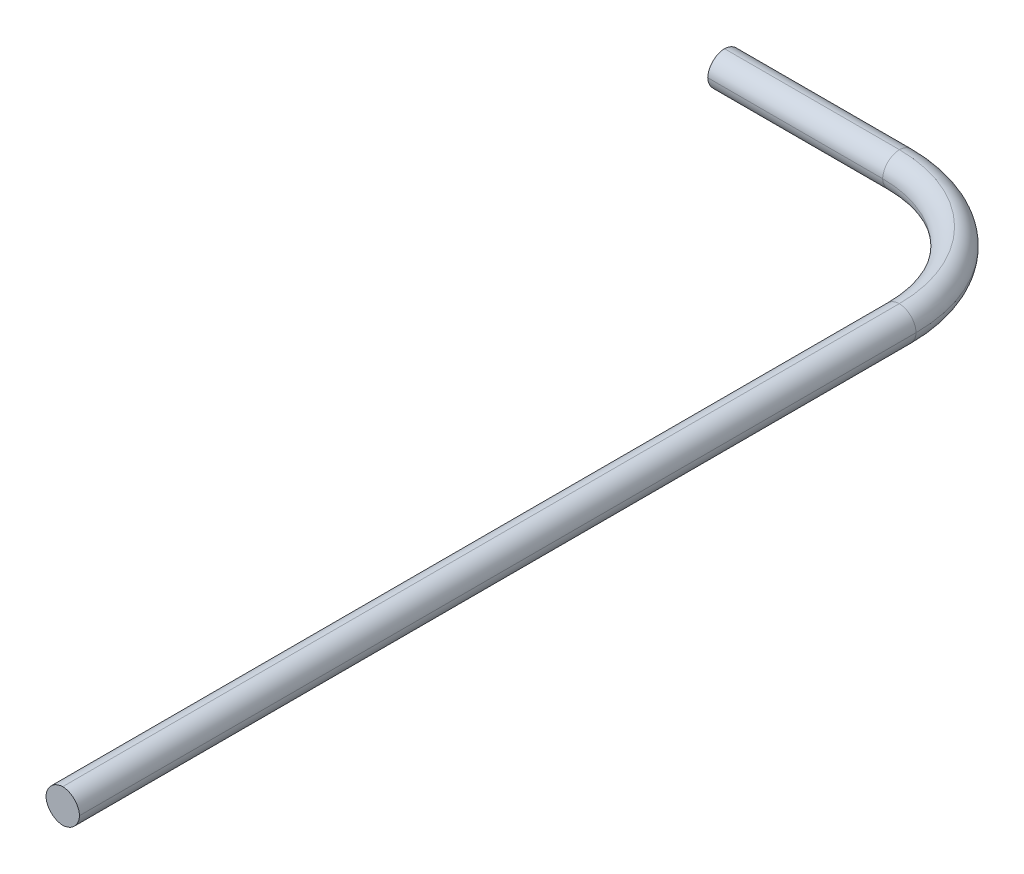
ISO-10303-21;
HEADER;
FILE_DESCRIPTION(('STEP AP214'),'2;1');
FILE_NAME('part.step','',(''),(''),'','','');
FILE_SCHEMA(('AUTOMOTIVE_DESIGN { 1 0 10303 214 1 1 1 1 }'));
ENDSEC;
DATA;
#1=APPLICATION_CONTEXT('core data for automotive mechanical design processes');
#2=APPLICATION_PROTOCOL_DEFINITION('international standard','automotive_design',2000,#1);
#3=PRODUCT_CONTEXT('',#1,'mechanical');
#4=PRODUCT('Part','Part','',(#3));
#5=PRODUCT_RELATED_PRODUCT_CATEGORY('part','',(#4));
#6=PRODUCT_DEFINITION_FORMATION('','',#4);
#7=PRODUCT_DEFINITION_CONTEXT('part definition',#1,'design');
#8=PRODUCT_DEFINITION('design','',#6,#7);
#9=PRODUCT_DEFINITION_SHAPE('','',#8);
#10=(LENGTH_UNIT() NAMED_UNIT(*) SI_UNIT(.MILLI.,.METRE.));
#11=(NAMED_UNIT(*) PLANE_ANGLE_UNIT() SI_UNIT($,.RADIAN.));
#12=(NAMED_UNIT(*) SI_UNIT($,.STERADIAN.) SOLID_ANGLE_UNIT());
#13=UNCERTAINTY_MEASURE_WITH_UNIT(LENGTH_MEASURE(1.E-05),#10,'distance_accuracy_value','');
#14=(GEOMETRIC_REPRESENTATION_CONTEXT(3) GLOBAL_UNCERTAINTY_ASSIGNED_CONTEXT((#13)) GLOBAL_UNIT_ASSIGNED_CONTEXT((#10,
#11,#12)) REPRESENTATION_CONTEXT('',''));
#15=CARTESIAN_POINT('',(0.,0.,0.));
#16=DIRECTION('',(0.,0.,1.));
#17=DIRECTION('',(1.,0.,0.));
#18=AXIS2_PLACEMENT_3D('',#15,#16,#17);
#19=CARTESIAN_POINT('',(0.,0.,338.5));
#20=DIRECTION('',(0.,0.,1.));
#21=DIRECTION('',(1.,0.,0.));
#22=AXIS2_PLACEMENT_3D('',#19,#20,#21);
#23=PLANE('',#22);
#24=CARTESIAN_POINT('',(0.250000000000001,-0.25,338.5));
#25=DIRECTION('',(0.,0.,1.));
#26=DIRECTION('',(1.,0.,0.));
#27=AXIS2_PLACEMENT_3D('',#24,#25,#26);
#28=CIRCLE('',#27,6.);
#29=CARTESIAN_POINT('',(0.,5.7447894041409,338.5));
#30=VERTEX_POINT('',#29);
#31=CARTESIAN_POINT('',(-5.7447894041409,0.,338.5));
#32=VERTEX_POINT('',#31);
#33=EDGE_CURVE('E177',#30,#32,#28,.T.);
#34=ORIENTED_EDGE('',*,*,#33,.T.);
#35=CARTESIAN_POINT('',(0.25,0.25,338.5));
#36=DIRECTION('',(0.,0.,1.));
#37=DIRECTION('',(1.,0.,0.));
#38=AXIS2_PLACEMENT_3D('',#35,#36,#37);
#39=CIRCLE('',#38,6.);
#40=CARTESIAN_POINT('',(0.,-5.7447894041409,338.5));
#41=VERTEX_POINT('',#40);
#42=EDGE_CURVE('E114',#32,#41,#39,.T.);
#43=ORIENTED_EDGE('',*,*,#42,.T.);
#44=CARTESIAN_POINT('',(-0.25,0.25,338.5));
#45=DIRECTION('',(0.,0.,1.));
#46=DIRECTION('',(1.,0.,0.));
#47=AXIS2_PLACEMENT_3D('',#44,#45,#46);
#48=CIRCLE('',#47,6.);
#49=CARTESIAN_POINT('',(5.7447894041409,0.,338.5));
#50=VERTEX_POINT('',#49);
#51=EDGE_CURVE('E95',#41,#50,#48,.T.);
#52=ORIENTED_EDGE('',*,*,#51,.T.);
#53=CARTESIAN_POINT('',(-0.25,-0.25,338.5));
#54=DIRECTION('',(0.,0.,1.));
#55=DIRECTION('',(1.,0.,0.));
#56=AXIS2_PLACEMENT_3D('',#53,#54,#55);
#57=CIRCLE('',#56,6.);
#58=EDGE_CURVE('E173',#50,#30,#57,.T.);
#59=ORIENTED_EDGE('',*,*,#58,.T.);
#60=EDGE_LOOP('',(#34,#43,#52,#59));
#61=FACE_BOUND('',#60,.T.);
#62=ADVANCED_FACE('F35',(#61),#23,.T.);
#63=CARTESIAN_POINT('',(-105.75,0.,0.));
#64=DIRECTION('',(1.,0.,0.));
#65=DIRECTION('',(0.,1.,0.));
#66=AXIS2_PLACEMENT_3D('',#63,#64,#65);
#67=PLANE('',#66);
#68=CARTESIAN_POINT('',(-105.75,0.25,6.00000000000001));
#69=DIRECTION('',(1.,0.,0.));
#70=DIRECTION('',(0.,1.,0.));
#71=AXIS2_PLACEMENT_3D('',#68,#69,#70);
#72=CIRCLE('',#71,6.);
#73=CARTESIAN_POINT('',(-105.75,0.,0.0052105958591054));
#74=VERTEX_POINT('',#73);
#75=CARTESIAN_POINT('',(-105.75,-5.7447894041409,5.75));
#76=VERTEX_POINT('',#75);
#77=EDGE_CURVE('E112',#74,#76,#72,.F.);
#78=ORIENTED_EDGE('',*,*,#77,.T.);
#79=CARTESIAN_POINT('',(-105.75,0.25,5.5));
#80=DIRECTION('',(1.,0.,0.));
#81=DIRECTION('',(0.,1.,0.));
#82=AXIS2_PLACEMENT_3D('',#79,#80,#81);
#83=CIRCLE('',#82,6.);
#84=CARTESIAN_POINT('',(-105.75,0.,11.4947894041409));
#85=VERTEX_POINT('',#84);
#86=EDGE_CURVE('E11',#76,#85,#83,.F.);
#87=ORIENTED_EDGE('',*,*,#86,.T.);
#88=CARTESIAN_POINT('',(-105.75,-0.25,5.50000000000001));
#89=DIRECTION('',(1.,0.,0.));
#90=DIRECTION('',(0.,1.,0.));
#91=AXIS2_PLACEMENT_3D('',#88,#89,#90);
#92=CIRCLE('',#91,6.);
#93=CARTESIAN_POINT('',(-105.75,5.7447894041409,5.75000000000001));
#94=VERTEX_POINT('',#93);
#95=EDGE_CURVE('E45',#85,#94,#92,.F.);
#96=ORIENTED_EDGE('',*,*,#95,.T.);
#97=CARTESIAN_POINT('',(-105.75,-0.25,6.00000000000001));
#98=DIRECTION('',(1.,0.,0.));
#99=DIRECTION('',(0.,1.,0.));
#100=AXIS2_PLACEMENT_3D('',#97,#98,#99);
#101=CIRCLE('',#100,6.);
#102=EDGE_CURVE('E109',#94,#74,#101,.F.);
#103=ORIENTED_EDGE('',*,*,#102,.T.);
#104=EDGE_LOOP('',(#78,#87,#96,#103));
#105=FACE_BOUND('',#104,.T.);
#106=ADVANCED_FACE('F110',(#105),#67,.F.);
#107=CARTESIAN_POINT('',(-5.75,-0.25,6.00000000000001));
#108=DIRECTION('',(-1.,0.,0.));
#109=DIRECTION('',(0.,0.,1.));
#110=AXIS2_PLACEMENT_3D('',#107,#108,#109);
#111=CYLINDRICAL_SURFACE('',#110,6.);
#112=DIRECTION('',(-1.,0.,0.));
#113=VECTOR('',#112,1.);
#114=CARTESIAN_POINT('',(-75.75,0.,0.00521059585910626));
#115=LINE('',#114,#113);
#116=CARTESIAN_POINT('',(-45.75,-2.15105711021124E-13,0.00521059585910279));
#117=VERTEX_POINT('',#116);
#118=EDGE_CURVE('E116',#74,#117,#115,.F.);
#119=ORIENTED_EDGE('',*,*,#118,.F.);
#120=ORIENTED_EDGE('',*,*,#102,.F.);
#121=DIRECTION('',(-1.,0.,0.));
#122=VECTOR('',#121,1.);
#123=CARTESIAN_POINT('',(-75.75,5.7447894041409,5.75000000000001));
#124=LINE('',#123,#122);
#125=CARTESIAN_POINT('',(-45.75,5.7447894041409,5.74999999999999));
#126=VERTEX_POINT('',#125);
#127=EDGE_CURVE('E39',#126,#94,#124,.T.);
#128=ORIENTED_EDGE('',*,*,#127,.F.);
#129=CARTESIAN_POINT('',(-45.75,-0.25,6.));
#130=DIRECTION('',(1.,0.,0.));
#131=DIRECTION('',(0.,0.,-1.));
#132=AXIS2_PLACEMENT_3D('',#129,#130,#131);
#133=CIRCLE('',#132,6.);
#134=EDGE_CURVE('E83',#117,#126,#133,.T.);
#135=ORIENTED_EDGE('',*,*,#134,.F.);
#136=EDGE_LOOP('',(#119,#120,#128,#135));
#137=FACE_BOUND('',#136,.T.);
#138=ADVANCED_FACE('F37',(#137),#111,.T.);
#139=CARTESIAN_POINT('',(-5.75,-0.25,5.50000000000001));
#140=DIRECTION('',(1.,0.,0.));
#141=DIRECTION('',(0.,0.,-1.));
#142=AXIS2_PLACEMENT_3D('',#139,#140,#141);
#143=CYLINDRICAL_SURFACE('',#142,6.);
#144=ORIENTED_EDGE('',*,*,#127,.T.);
#145=ORIENTED_EDGE('',*,*,#95,.F.);
#146=DIRECTION('',(1.,0.,0.));
#147=VECTOR('',#146,1.);
#148=CARTESIAN_POINT('',(-75.75,0.,11.4947894041409));
#149=LINE('',#148,#147);
#150=CARTESIAN_POINT('',(-45.75,0.,11.4947894041409));
#151=VERTEX_POINT('',#150);
#152=EDGE_CURVE('E54',#151,#85,#149,.F.);
#153=ORIENTED_EDGE('',*,*,#152,.F.);
#154=CARTESIAN_POINT('',(-45.75,-0.25,5.50000000000001));
#155=DIRECTION('',(1.,0.,0.));
#156=DIRECTION('',(0.,0.,-1.));
#157=AXIS2_PLACEMENT_3D('',#154,#155,#156);
#158=CIRCLE('',#157,6.);
#159=EDGE_CURVE('E167',#126,#151,#158,.T.);
#160=ORIENTED_EDGE('',*,*,#159,.F.);
#161=EDGE_LOOP('',(#144,#145,#153,#160));
#162=FACE_BOUND('',#161,.T.);
#163=ADVANCED_FACE('F288',(#162),#143,.T.);
#164=CARTESIAN_POINT('',(-45.75,-0.25,51.5));
#165=DIRECTION('',(0.,-1.,0.));
#166=DIRECTION('',(0.,0.,-1.));
#167=AXIS2_PLACEMENT_3D('',#164,#165,#166);
#168=TOROIDAL_SURFACE('',#167,45.5,6.);
#169=CARTESIAN_POINT('',(-45.75,0.,51.5));
#170=DIRECTION('',(0.,-1.,0.));
#171=DIRECTION('',(0.,0.,-1.));
#172=AXIS2_PLACEMENT_3D('',#169,#170,#171);
#173=CIRCLE('',#172,51.4947894041409);
#174=CARTESIAN_POINT('',(5.7447894041409,0.,51.5));
#175=VERTEX_POINT('',#174);
#176=EDGE_CURVE('E158',#117,#175,#173,.T.);
#177=ORIENTED_EDGE('',*,*,#176,.F.);
#178=ORIENTED_EDGE('',*,*,#134,.T.);
#179=CARTESIAN_POINT('',(-45.75,5.7447894041409,51.5));
#180=DIRECTION('',(0.,1.,0.));
#181=DIRECTION('',(0.,0.,1.));
#182=AXIS2_PLACEMENT_3D('',#179,#180,#181);
#183=CIRCLE('',#182,45.75);
#184=CARTESIAN_POINT('',(0.,5.7447894041409,51.5));
#185=VERTEX_POINT('',#184);
#186=EDGE_CURVE('E164',#185,#126,#183,.T.);
#187=ORIENTED_EDGE('',*,*,#186,.F.);
#188=CARTESIAN_POINT('',(-0.25,-0.25,51.5));
#189=DIRECTION('',(0.,0.,1.));
#190=DIRECTION('',(1.,0.,0.));
#191=AXIS2_PLACEMENT_3D('',#188,#189,#190);
#192=CIRCLE('',#191,6.);
#193=EDGE_CURVE('E161',#175,#185,#192,.T.);
#194=ORIENTED_EDGE('',*,*,#193,.F.);
#195=EDGE_LOOP('',(#177,#178,#187,#194));
#196=FACE_BOUND('',#195,.T.);
#197=ADVANCED_FACE('F202',(#196),#168,.T.);
#198=CARTESIAN_POINT('',(-5.75,0.25,6.00000000000001));
#199=DIRECTION('',(1.,0.,0.));
#200=DIRECTION('',(0.,0.,-1.));
#201=AXIS2_PLACEMENT_3D('',#198,#199,#200);
#202=CYLINDRICAL_SURFACE('',#201,6.);
#203=DIRECTION('',(1.,0.,0.));
#204=VECTOR('',#203,1.);
#205=CARTESIAN_POINT('',(-75.75,-5.7447894041409,5.75));
#206=LINE('',#205,#204);
#207=CARTESIAN_POINT('',(-45.75,-5.7447894041409,5.75000000000001));
#208=VERTEX_POINT('',#207);
#209=EDGE_CURVE('E120',#76,#208,#206,.T.);
#210=ORIENTED_EDGE('',*,*,#209,.F.);
#211=ORIENTED_EDGE('',*,*,#77,.F.);
#212=ORIENTED_EDGE('',*,*,#118,.T.);
#213=CARTESIAN_POINT('',(-45.75,0.25,6.00000000000001));
#214=DIRECTION('',(1.,0.,0.));
#215=DIRECTION('',(0.,0.,-1.));
#216=AXIS2_PLACEMENT_3D('',#213,#214,#215);
#217=CIRCLE('',#216,6.);
#218=EDGE_CURVE('E155',#208,#117,#217,.T.);
#219=ORIENTED_EDGE('',*,*,#218,.F.);
#220=EDGE_LOOP('',(#210,#211,#212,#219));
#221=FACE_BOUND('',#220,.T.);
#222=ADVANCED_FACE('F122',(#221),#202,.T.);
#223=CARTESIAN_POINT('',(-105.75,0.25,5.5));
#224=DIRECTION('',(1.,0.,0.));
#225=DIRECTION('',(0.,0.,-1.));
#226=AXIS2_PLACEMENT_3D('',#223,#224,#225);
#227=CYLINDRICAL_SURFACE('',#226,6.);
#228=ORIENTED_EDGE('',*,*,#86,.F.);
#229=ORIENTED_EDGE('',*,*,#209,.T.);
#230=CARTESIAN_POINT('',(-45.75,0.25,5.5));
#231=DIRECTION('',(1.,0.,0.));
#232=DIRECTION('',(0.,0.,-1.));
#233=AXIS2_PLACEMENT_3D('',#230,#231,#232);
#234=CIRCLE('',#233,6.);
#235=EDGE_CURVE('E150',#151,#208,#234,.T.);
#236=ORIENTED_EDGE('',*,*,#235,.F.);
#237=ORIENTED_EDGE('',*,*,#152,.T.);
#238=EDGE_LOOP('',(#228,#229,#236,#237));
#239=FACE_BOUND('',#238,.T.);
#240=ADVANCED_FACE('F204',(#239),#227,.T.);
#241=CARTESIAN_POINT('',(-45.75,-0.25,51.5));
#242=DIRECTION('',(0.,-1.,0.));
#243=DIRECTION('',(0.,0.,-1.));
#244=AXIS2_PLACEMENT_3D('',#241,#242,#243);
#245=TOROIDAL_SURFACE('',#244,46.,6.);
#246=ORIENTED_EDGE('',*,*,#186,.T.);
#247=ORIENTED_EDGE('',*,*,#159,.T.);
#248=CARTESIAN_POINT('',(-45.75,0.,51.5));
#249=DIRECTION('',(0.,1.,0.));
#250=DIRECTION('',(0.,0.,1.));
#251=AXIS2_PLACEMENT_3D('',#248,#249,#250);
#252=CIRCLE('',#251,40.0052105958591);
#253=CARTESIAN_POINT('',(-5.7447894041409,0.,51.5));
#254=VERTEX_POINT('',#253);
#255=EDGE_CURVE('E147',#254,#151,#252,.T.);
#256=ORIENTED_EDGE('',*,*,#255,.F.);
#257=CARTESIAN_POINT('',(0.250000000000001,-0.25,51.5));
#258=DIRECTION('',(0.,0.,1.));
#259=DIRECTION('',(1.,0.,0.));
#260=AXIS2_PLACEMENT_3D('',#257,#258,#259);
#261=CIRCLE('',#260,6.);
#262=EDGE_CURVE('E144',#185,#254,#261,.T.);
#263=ORIENTED_EDGE('',*,*,#262,.F.);
#264=EDGE_LOOP('',(#246,#247,#256,#263));
#265=FACE_BOUND('',#264,.T.);
#266=ADVANCED_FACE('F203',(#265),#245,.T.);
#267=CARTESIAN_POINT('',(-0.25,-0.25,338.5));
#268=DIRECTION('',(0.,0.,-1.));
#269=DIRECTION('',(-1.,0.,0.));
#270=AXIS2_PLACEMENT_3D('',#267,#268,#269);
#271=CYLINDRICAL_SURFACE('',#270,6.);
#272=DIRECTION('',(0.,0.,-1.));
#273=VECTOR('',#272,1.);
#274=CARTESIAN_POINT('',(5.7447894041409,0.,195.));
#275=LINE('',#274,#273);
#276=EDGE_CURVE('E138',#175,#50,#275,.F.);
#277=ORIENTED_EDGE('',*,*,#276,.F.);
#278=ORIENTED_EDGE('',*,*,#193,.T.);
#279=DIRECTION('',(0.,0.,-1.));
#280=VECTOR('',#279,1.);
#281=CARTESIAN_POINT('',(0.,5.7447894041409,195.));
#282=LINE('',#281,#280);
#283=EDGE_CURVE('E141',#30,#185,#282,.T.);
#284=ORIENTED_EDGE('',*,*,#283,.F.);
#285=ORIENTED_EDGE('',*,*,#58,.F.);
#286=EDGE_LOOP('',(#277,#278,#284,#285));
#287=FACE_BOUND('',#286,.T.);
#288=ADVANCED_FACE('F192',(#287),#271,.T.);
#289=CARTESIAN_POINT('',(-45.75,0.25,51.5));
#290=DIRECTION('',(0.,1.,0.));
#291=DIRECTION('',(0.,0.,1.));
#292=AXIS2_PLACEMENT_3D('',#289,#290,#291);
#293=TOROIDAL_SURFACE('',#292,45.5,6.);
#294=CARTESIAN_POINT('',(-45.75,-5.7447894041409,51.5));
#295=DIRECTION('',(0.,-1.,0.));
#296=DIRECTION('',(0.,0.,-1.));
#297=AXIS2_PLACEMENT_3D('',#294,#295,#296);
#298=CIRCLE('',#297,45.75);
#299=CARTESIAN_POINT('',(0.,-5.7447894041409,51.5));
#300=VERTEX_POINT('',#299);
#301=EDGE_CURVE('E153',#208,#300,#298,.T.);
#302=ORIENTED_EDGE('',*,*,#301,.F.);
#303=ORIENTED_EDGE('',*,*,#218,.T.);
#304=ORIENTED_EDGE('',*,*,#176,.T.);
#305=CARTESIAN_POINT('',(-0.25,0.25,51.5));
#306=DIRECTION('',(0.,0.,1.));
#307=DIRECTION('',(1.,0.,0.));
#308=AXIS2_PLACEMENT_3D('',#305,#306,#307);
#309=CIRCLE('',#308,6.);
#310=EDGE_CURVE('E135',#300,#175,#309,.T.);
#311=ORIENTED_EDGE('',*,*,#310,.F.);
#312=EDGE_LOOP('',(#302,#303,#304,#311));
#313=FACE_BOUND('',#312,.T.);
#314=ADVANCED_FACE('F201',(#313),#293,.T.);
#315=CARTESIAN_POINT('',(-45.75,0.25,51.5));
#316=DIRECTION('',(0.,1.,0.));
#317=DIRECTION('',(0.,0.,1.));
#318=AXIS2_PLACEMENT_3D('',#315,#316,#317);
#319=TOROIDAL_SURFACE('',#318,46.,6.);
#320=ORIENTED_EDGE('',*,*,#235,.T.);
#321=ORIENTED_EDGE('',*,*,#301,.T.);
#322=CARTESIAN_POINT('',(0.25,0.25,51.5));
#323=DIRECTION('',(0.,0.,1.));
#324=DIRECTION('',(1.,0.,0.));
#325=AXIS2_PLACEMENT_3D('',#322,#323,#324);
#326=CIRCLE('',#325,6.);
#327=EDGE_CURVE('E132',#254,#300,#326,.T.);
#328=ORIENTED_EDGE('',*,*,#327,.F.);
#329=ORIENTED_EDGE('',*,*,#255,.T.);
#330=EDGE_LOOP('',(#320,#321,#328,#329));
#331=FACE_BOUND('',#330,.T.);
#332=ADVANCED_FACE('F198',(#331),#319,.T.);
#333=CARTESIAN_POINT('',(0.250000000000001,-0.25,338.5));
#334=DIRECTION('',(0.,0.,-1.));
#335=DIRECTION('',(-1.,0.,0.));
#336=AXIS2_PLACEMENT_3D('',#333,#334,#335);
#337=CYLINDRICAL_SURFACE('',#336,6.);
#338=ORIENTED_EDGE('',*,*,#283,.T.);
#339=ORIENTED_EDGE('',*,*,#262,.T.);
#340=DIRECTION('',(0.,0.,-1.));
#341=VECTOR('',#340,1.);
#342=CARTESIAN_POINT('',(-5.7447894041409,0.,195.));
#343=LINE('',#342,#341);
#344=EDGE_CURVE('E129',#32,#254,#343,.T.);
#345=ORIENTED_EDGE('',*,*,#344,.F.);
#346=ORIENTED_EDGE('',*,*,#33,.F.);
#347=EDGE_LOOP('',(#338,#339,#345,#346));
#348=FACE_BOUND('',#347,.T.);
#349=ADVANCED_FACE('F195',(#348),#337,.T.);
#350=CARTESIAN_POINT('',(-0.25,0.25,338.5));
#351=DIRECTION('',(0.,0.,-1.));
#352=DIRECTION('',(-1.,0.,0.));
#353=AXIS2_PLACEMENT_3D('',#350,#351,#352);
#354=CYLINDRICAL_SURFACE('',#353,6.);
#355=ORIENTED_EDGE('',*,*,#276,.T.);
#356=ORIENTED_EDGE('',*,*,#51,.F.);
#357=DIRECTION('',(0.,0.,-1.));
#358=VECTOR('',#357,1.);
#359=CARTESIAN_POINT('',(0.,-5.7447894041409,195.));
#360=LINE('',#359,#358);
#361=EDGE_CURVE('E127',#300,#41,#360,.F.);
#362=ORIENTED_EDGE('',*,*,#361,.F.);
#363=ORIENTED_EDGE('',*,*,#310,.T.);
#364=EDGE_LOOP('',(#355,#356,#362,#363));
#365=FACE_BOUND('',#364,.T.);
#366=ADVANCED_FACE('F188',(#365),#354,.T.);
#367=CARTESIAN_POINT('',(0.25,0.25,338.5));
#368=DIRECTION('',(0.,0.,-1.));
#369=DIRECTION('',(-1.,0.,0.));
#370=AXIS2_PLACEMENT_3D('',#367,#368,#369);
#371=CYLINDRICAL_SURFACE('',#370,6.);
#372=ORIENTED_EDGE('',*,*,#344,.T.);
#373=ORIENTED_EDGE('',*,*,#327,.T.);
#374=ORIENTED_EDGE('',*,*,#361,.T.);
#375=ORIENTED_EDGE('',*,*,#42,.F.);
#376=EDGE_LOOP('',(#372,#373,#374,#375));
#377=FACE_BOUND('',#376,.T.);
#378=ADVANCED_FACE('F184',(#377),#371,.T.);
#379=CLOSED_SHELL('',(#62,#106,#138,#163,#197,#222,#240,#266,#288,#314,#332,#349,#366,#378));
#380=MANIFOLD_SOLID_BREP('B2',#379);
#381=ADVANCED_BREP_SHAPE_REPRESENTATION('',(#18,#380),#14);
#382=SHAPE_DEFINITION_REPRESENTATION(#9,#381);
ENDSEC;
END-ISO-10303-21;
